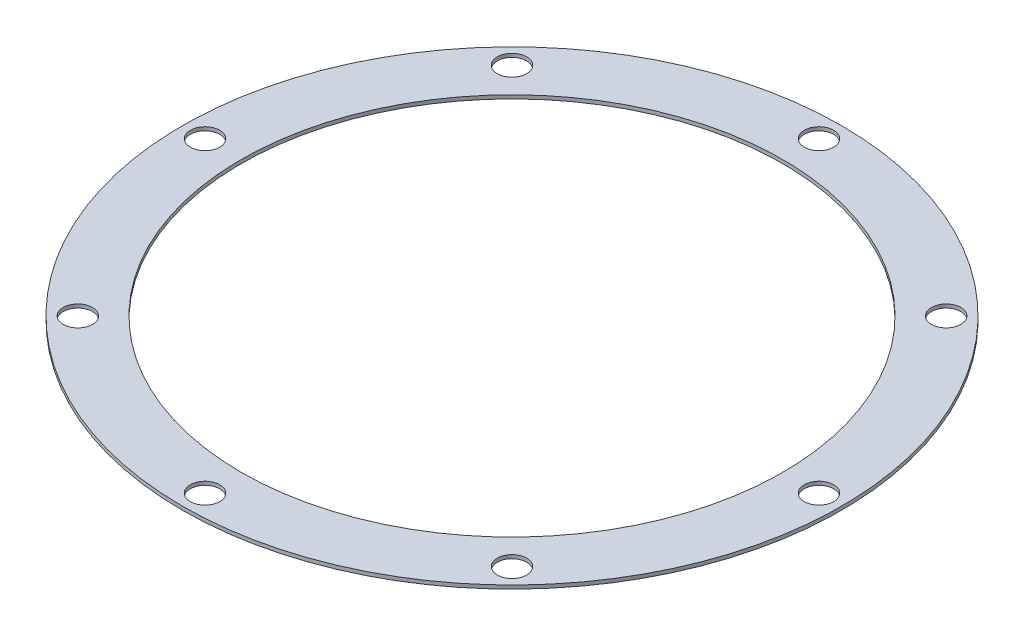
ISO-10303-21;
HEADER;
FILE_DESCRIPTION(('STEP AP214'),'2;1');
FILE_NAME('part.step','',(''),(''),'','','');
FILE_SCHEMA(('AUTOMOTIVE_DESIGN { 1 0 10303 214 1 1 1 1 }'));
ENDSEC;
DATA;
#1=APPLICATION_CONTEXT('core data for automotive mechanical design processes');
#2=APPLICATION_PROTOCOL_DEFINITION('international standard','automotive_design',2000,#1);
#3=PRODUCT_CONTEXT('',#1,'mechanical');
#4=PRODUCT('Part','Part','',(#3));
#5=PRODUCT_RELATED_PRODUCT_CATEGORY('part','',(#4));
#6=PRODUCT_DEFINITION_FORMATION('','',#4);
#7=PRODUCT_DEFINITION_CONTEXT('part definition',#1,'design');
#8=PRODUCT_DEFINITION('design','',#6,#7);
#9=PRODUCT_DEFINITION_SHAPE('','',#8);
#10=(LENGTH_UNIT() NAMED_UNIT(*) SI_UNIT(.MILLI.,.METRE.));
#11=(NAMED_UNIT(*) PLANE_ANGLE_UNIT() SI_UNIT($,.RADIAN.));
#12=(NAMED_UNIT(*) SI_UNIT($,.STERADIAN.) SOLID_ANGLE_UNIT());
#13=UNCERTAINTY_MEASURE_WITH_UNIT(LENGTH_MEASURE(1.E-05),#10,'distance_accuracy_value','');
#14=(GEOMETRIC_REPRESENTATION_CONTEXT(3) GLOBAL_UNCERTAINTY_ASSIGNED_CONTEXT((#13)) GLOBAL_UNIT_ASSIGNED_CONTEXT((#10,
#11,#12)) REPRESENTATION_CONTEXT('',''));
#15=CARTESIAN_POINT('',(0.,0.,0.));
#16=DIRECTION('',(0.,0.,1.));
#17=DIRECTION('',(1.,0.,0.));
#18=AXIS2_PLACEMENT_3D('',#15,#16,#17);
#19=CARTESIAN_POINT('',(0.,0.79375,0.));
#20=DIRECTION('',(0.,1.,0.));
#21=DIRECTION('',(0.,0.,1.));
#22=AXIS2_PLACEMENT_3D('',#19,#20,#21);
#23=PLANE('',#22);
#24=CARTESIAN_POINT('',(0.,0.79375,68.));
#25=DIRECTION('',(0.,1.,0.));
#26=DIRECTION('',(0.,0.,1.));
#27=AXIS2_PLACEMENT_3D('',#24,#25,#26);
#28=CIRCLE('',#27,3.25);
#29=CARTESIAN_POINT('',(0.,0.79375,71.25));
#30=VERTEX_POINT('',#29);
#31=EDGE_CURVE('E83',#30,#30,#28,.T.);
#32=ORIENTED_EDGE('',*,*,#31,.F.);
#33=EDGE_LOOP('',(#32));
#34=FACE_BOUND('',#33,.T.);
#35=CARTESIAN_POINT('',(68.,0.79375,0.));
#36=DIRECTION('',(0.,1.,0.));
#37=DIRECTION('',(0.,0.,1.));
#38=AXIS2_PLACEMENT_3D('',#35,#36,#37);
#39=CIRCLE('',#38,3.25000000000001);
#40=CARTESIAN_POINT('',(68.,0.79375,3.25));
#41=VERTEX_POINT('',#40);
#42=EDGE_CURVE('E71',#41,#41,#39,.T.);
#43=ORIENTED_EDGE('',*,*,#42,.F.);
#44=EDGE_LOOP('',(#43));
#45=FACE_BOUND('',#44,.T.);
#46=CARTESIAN_POINT('',(0.,0.79375,-68.));
#47=DIRECTION('',(0.,1.,0.));
#48=DIRECTION('',(0.,0.,1.));
#49=AXIS2_PLACEMENT_3D('',#46,#47,#48);
#50=CIRCLE('',#49,3.25);
#51=CARTESIAN_POINT('',(0.,0.79375,-64.75));
#52=VERTEX_POINT('',#51);
#53=EDGE_CURVE('E59',#52,#52,#50,.T.);
#54=ORIENTED_EDGE('',*,*,#53,.F.);
#55=EDGE_LOOP('',(#54));
#56=FACE_BOUND('',#55,.T.);
#57=CARTESIAN_POINT('',(-68.,0.79375,0.));
#58=DIRECTION('',(0.,1.,0.));
#59=DIRECTION('',(0.,0.,1.));
#60=AXIS2_PLACEMENT_3D('',#57,#58,#59);
#61=CIRCLE('',#60,3.25000000000001);
#62=CARTESIAN_POINT('',(-68.,0.79375,3.25000000000001));
#63=VERTEX_POINT('',#62);
#64=EDGE_CURVE('E47',#63,#63,#61,.T.);
#65=ORIENTED_EDGE('',*,*,#64,.F.);
#66=EDGE_LOOP('',(#65));
#67=FACE_BOUND('',#66,.T.);
#68=CARTESIAN_POINT('',(0.,0.79375,0.));
#69=DIRECTION('',(0.,1.,0.));
#70=DIRECTION('',(0.,0.,1.));
#71=AXIS2_PLACEMENT_3D('',#68,#69,#70);
#72=CIRCLE('',#71,73.);
#73=CARTESIAN_POINT('',(0.,0.79375,73.));
#74=VERTEX_POINT('',#73);
#75=EDGE_CURVE('E10',#74,#74,#72,.T.);
#76=ORIENTED_EDGE('',*,*,#75,.T.);
#77=EDGE_LOOP('',(#76));
#78=FACE_BOUND('',#77,.T.);
#79=CARTESIAN_POINT('',(0.,0.79375,0.));
#80=DIRECTION('',(0.,1.,0.));
#81=DIRECTION('',(0.,0.,1.));
#82=AXIS2_PLACEMENT_3D('',#79,#80,#81);
#83=CIRCLE('',#82,60.);
#84=CARTESIAN_POINT('',(0.,0.79375,60.));
#85=VERTEX_POINT('',#84);
#86=EDGE_CURVE('E42',#85,#85,#83,.T.);
#87=ORIENTED_EDGE('',*,*,#86,.F.);
#88=EDGE_LOOP('',(#87));
#89=FACE_BOUND('',#88,.T.);
#90=CARTESIAN_POINT('',(-48.0832611206852,0.79375,-48.0832611206852));
#91=DIRECTION('',(0.,1.,0.));
#92=DIRECTION('',(0.,0.,1.));
#93=AXIS2_PLACEMENT_3D('',#90,#91,#92);
#94=CIRCLE('',#93,3.25);
#95=CARTESIAN_POINT('',(-48.0832611206852,0.79375,-44.8332611206852));
#96=VERTEX_POINT('',#95);
#97=EDGE_CURVE('E53',#96,#96,#94,.T.);
#98=ORIENTED_EDGE('',*,*,#97,.F.);
#99=EDGE_LOOP('',(#98));
#100=FACE_BOUND('',#99,.T.);
#101=CARTESIAN_POINT('',(48.0832611206852,0.79375,-48.0832611206852));
#102=DIRECTION('',(0.,1.,0.));
#103=DIRECTION('',(0.,0.,1.));
#104=AXIS2_PLACEMENT_3D('',#101,#102,#103);
#105=CIRCLE('',#104,3.25);
#106=CARTESIAN_POINT('',(48.0832611206852,0.79375,-44.8332611206852));
#107=VERTEX_POINT('',#106);
#108=EDGE_CURVE('E65',#107,#107,#105,.T.);
#109=ORIENTED_EDGE('',*,*,#108,.F.);
#110=EDGE_LOOP('',(#109));
#111=FACE_BOUND('',#110,.T.);
#112=CARTESIAN_POINT('',(48.0832611206853,0.79375,48.0832611206852));
#113=DIRECTION('',(0.,1.,0.));
#114=DIRECTION('',(0.,0.,1.));
#115=AXIS2_PLACEMENT_3D('',#112,#113,#114);
#116=CIRCLE('',#115,3.25);
#117=CARTESIAN_POINT('',(48.0832611206853,0.79375,51.3332611206852));
#118=VERTEX_POINT('',#117);
#119=EDGE_CURVE('E77',#118,#118,#116,.T.);
#120=ORIENTED_EDGE('',*,*,#119,.F.);
#121=EDGE_LOOP('',(#120));
#122=FACE_BOUND('',#121,.T.);
#123=CARTESIAN_POINT('',(-48.0832611206852,0.79375,48.0832611206853));
#124=DIRECTION('',(0.,1.,0.));
#125=DIRECTION('',(0.,0.,1.));
#126=AXIS2_PLACEMENT_3D('',#123,#124,#125);
#127=CIRCLE('',#126,3.25);
#128=CARTESIAN_POINT('',(-48.0832611206852,0.79375,51.3332611206853));
#129=VERTEX_POINT('',#128);
#130=EDGE_CURVE('E89',#129,#129,#127,.T.);
#131=ORIENTED_EDGE('',*,*,#130,.F.);
#132=EDGE_LOOP('',(#131));
#133=FACE_BOUND('',#132,.T.);
#134=ADVANCED_FACE('F31',(#34,#45,#56,#67,#78,#89,#100,#111,#122,#133),#23,.T.);
#135=CARTESIAN_POINT('',(0.,0.,0.));
#136=DIRECTION('',(0.,1.,0.));
#137=DIRECTION('',(0.,0.,1.));
#138=AXIS2_PLACEMENT_3D('',#135,#136,#137);
#139=PLANE('',#138);
#140=CARTESIAN_POINT('',(0.,0.,68.));
#141=DIRECTION('',(0.,1.,0.));
#142=DIRECTION('',(0.,0.,1.));
#143=AXIS2_PLACEMENT_3D('',#140,#141,#142);
#144=CIRCLE('',#143,3.25);
#145=CARTESIAN_POINT('',(0.,0.,71.25));
#146=VERTEX_POINT('',#145);
#147=EDGE_CURVE('E86',#146,#146,#144,.T.);
#148=ORIENTED_EDGE('',*,*,#147,.T.);
#149=EDGE_LOOP('',(#148));
#150=FACE_BOUND('',#149,.T.);
#151=CARTESIAN_POINT('',(68.,0.,0.));
#152=DIRECTION('',(0.,1.,0.));
#153=DIRECTION('',(0.,0.,1.));
#154=AXIS2_PLACEMENT_3D('',#151,#152,#153);
#155=CIRCLE('',#154,3.25000000000001);
#156=CARTESIAN_POINT('',(68.,0.,3.25));
#157=VERTEX_POINT('',#156);
#158=EDGE_CURVE('E74',#157,#157,#155,.T.);
#159=ORIENTED_EDGE('',*,*,#158,.T.);
#160=EDGE_LOOP('',(#159));
#161=FACE_BOUND('',#160,.T.);
#162=CARTESIAN_POINT('',(0.,0.,-68.));
#163=DIRECTION('',(0.,1.,0.));
#164=DIRECTION('',(0.,0.,1.));
#165=AXIS2_PLACEMENT_3D('',#162,#163,#164);
#166=CIRCLE('',#165,3.25);
#167=CARTESIAN_POINT('',(0.,0.,-64.75));
#168=VERTEX_POINT('',#167);
#169=EDGE_CURVE('E62',#168,#168,#166,.T.);
#170=ORIENTED_EDGE('',*,*,#169,.T.);
#171=EDGE_LOOP('',(#170));
#172=FACE_BOUND('',#171,.T.);
#173=CARTESIAN_POINT('',(-68.,0.,0.));
#174=DIRECTION('',(0.,1.,0.));
#175=DIRECTION('',(0.,0.,1.));
#176=AXIS2_PLACEMENT_3D('',#173,#174,#175);
#177=CIRCLE('',#176,3.25000000000001);
#178=CARTESIAN_POINT('',(-68.,0.,3.25000000000001));
#179=VERTEX_POINT('',#178);
#180=EDGE_CURVE('E50',#179,#179,#177,.T.);
#181=ORIENTED_EDGE('',*,*,#180,.T.);
#182=EDGE_LOOP('',(#181));
#183=FACE_BOUND('',#182,.T.);
#184=CARTESIAN_POINT('',(0.,0.,0.));
#185=DIRECTION('',(0.,1.,0.));
#186=DIRECTION('',(0.,0.,1.));
#187=AXIS2_PLACEMENT_3D('',#184,#185,#186);
#188=CIRCLE('',#187,73.);
#189=CARTESIAN_POINT('',(0.,0.,73.));
#190=VERTEX_POINT('',#189);
#191=EDGE_CURVE('E35',#190,#190,#188,.T.);
#192=ORIENTED_EDGE('',*,*,#191,.F.);
#193=EDGE_LOOP('',(#192));
#194=FACE_BOUND('',#193,.T.);
#195=CARTESIAN_POINT('',(0.,0.,0.));
#196=DIRECTION('',(0.,1.,0.));
#197=DIRECTION('',(0.,0.,1.));
#198=AXIS2_PLACEMENT_3D('',#195,#196,#197);
#199=CIRCLE('',#198,60.);
#200=CARTESIAN_POINT('',(0.,0.,60.));
#201=VERTEX_POINT('',#200);
#202=EDGE_CURVE('E44',#201,#201,#199,.T.);
#203=ORIENTED_EDGE('',*,*,#202,.T.);
#204=EDGE_LOOP('',(#203));
#205=FACE_BOUND('',#204,.T.);
#206=CARTESIAN_POINT('',(-48.0832611206852,0.,-48.0832611206852));
#207=DIRECTION('',(0.,1.,0.));
#208=DIRECTION('',(0.,0.,1.));
#209=AXIS2_PLACEMENT_3D('',#206,#207,#208);
#210=CIRCLE('',#209,3.25);
#211=CARTESIAN_POINT('',(-48.0832611206852,0.,-44.8332611206852));
#212=VERTEX_POINT('',#211);
#213=EDGE_CURVE('E56',#212,#212,#210,.T.);
#214=ORIENTED_EDGE('',*,*,#213,.T.);
#215=EDGE_LOOP('',(#214));
#216=FACE_BOUND('',#215,.T.);
#217=CARTESIAN_POINT('',(48.0832611206852,0.,-48.0832611206852));
#218=DIRECTION('',(0.,1.,0.));
#219=DIRECTION('',(0.,0.,1.));
#220=AXIS2_PLACEMENT_3D('',#217,#218,#219);
#221=CIRCLE('',#220,3.25);
#222=CARTESIAN_POINT('',(48.0832611206852,0.,-44.8332611206852));
#223=VERTEX_POINT('',#222);
#224=EDGE_CURVE('E68',#223,#223,#221,.T.);
#225=ORIENTED_EDGE('',*,*,#224,.T.);
#226=EDGE_LOOP('',(#225));
#227=FACE_BOUND('',#226,.T.);
#228=CARTESIAN_POINT('',(48.0832611206853,0.,48.0832611206852));
#229=DIRECTION('',(0.,1.,0.));
#230=DIRECTION('',(0.,0.,1.));
#231=AXIS2_PLACEMENT_3D('',#228,#229,#230);
#232=CIRCLE('',#231,3.25);
#233=CARTESIAN_POINT('',(48.0832611206853,0.,51.3332611206852));
#234=VERTEX_POINT('',#233);
#235=EDGE_CURVE('E80',#234,#234,#232,.T.);
#236=ORIENTED_EDGE('',*,*,#235,.T.);
#237=EDGE_LOOP('',(#236));
#238=FACE_BOUND('',#237,.T.);
#239=CARTESIAN_POINT('',(-48.0832611206852,0.,48.0832611206853));
#240=DIRECTION('',(0.,1.,0.));
#241=DIRECTION('',(0.,0.,1.));
#242=AXIS2_PLACEMENT_3D('',#239,#240,#241);
#243=CIRCLE('',#242,3.25);
#244=CARTESIAN_POINT('',(-48.0832611206852,0.,51.3332611206853));
#245=VERTEX_POINT('',#244);
#246=EDGE_CURVE('E92',#245,#245,#243,.T.);
#247=ORIENTED_EDGE('',*,*,#246,.T.);
#248=EDGE_LOOP('',(#247));
#249=FACE_BOUND('',#248,.T.);
#250=ADVANCED_FACE('F102',(#150,#161,#172,#183,#194,#205,#216,#227,#238,#249),#139,.F.);
#251=CARTESIAN_POINT('',(0.,0.79375,0.));
#252=DIRECTION('',(0.,-1.,0.));
#253=DIRECTION('',(0.,0.,-1.));
#254=AXIS2_PLACEMENT_3D('',#251,#252,#253);
#255=CYLINDRICAL_SURFACE('',#254,73.);
#256=ORIENTED_EDGE('',*,*,#75,.F.);
#257=EDGE_LOOP('',(#256));
#258=FACE_BOUND('',#257,.T.);
#259=ORIENTED_EDGE('',*,*,#191,.T.);
#260=EDGE_LOOP('',(#259));
#261=FACE_BOUND('',#260,.T.);
#262=ADVANCED_FACE('F33',(#258,#261),#255,.T.);
#263=CARTESIAN_POINT('',(0.,0.79375,0.));
#264=DIRECTION('',(0.,-1.,0.));
#265=DIRECTION('',(0.,0.,-1.));
#266=AXIS2_PLACEMENT_3D('',#263,#264,#265);
#267=CYLINDRICAL_SURFACE('',#266,60.);
#268=ORIENTED_EDGE('',*,*,#86,.T.);
#269=EDGE_LOOP('',(#268));
#270=FACE_BOUND('',#269,.T.);
#271=ORIENTED_EDGE('',*,*,#202,.F.);
#272=EDGE_LOOP('',(#271));
#273=FACE_BOUND('',#272,.T.);
#274=ADVANCED_FACE('F112',(#270,#273),#267,.F.);
#275=CARTESIAN_POINT('',(-68.,0.79375,0.));
#276=DIRECTION('',(0.,-1.,0.));
#277=DIRECTION('',(0.,0.,-1.));
#278=AXIS2_PLACEMENT_3D('',#275,#276,#277);
#279=CYLINDRICAL_SURFACE('',#278,3.25000000000001);
#280=ORIENTED_EDGE('',*,*,#64,.T.);
#281=EDGE_LOOP('',(#280));
#282=FACE_BOUND('',#281,.T.);
#283=ORIENTED_EDGE('',*,*,#180,.F.);
#284=EDGE_LOOP('',(#283));
#285=FACE_BOUND('',#284,.T.);
#286=ADVANCED_FACE('F115',(#282,#285),#279,.F.);
#287=CARTESIAN_POINT('',(-48.0832611206852,0.79375,-48.0832611206852));
#288=DIRECTION('',(0.,-1.,0.));
#289=DIRECTION('',(0.,0.,-1.));
#290=AXIS2_PLACEMENT_3D('',#287,#288,#289);
#291=CYLINDRICAL_SURFACE('',#290,3.25);
#292=ORIENTED_EDGE('',*,*,#97,.T.);
#293=EDGE_LOOP('',(#292));
#294=FACE_BOUND('',#293,.T.);
#295=ORIENTED_EDGE('',*,*,#213,.F.);
#296=EDGE_LOOP('',(#295));
#297=FACE_BOUND('',#296,.T.);
#298=ADVANCED_FACE('F119',(#294,#297),#291,.F.);
#299=CARTESIAN_POINT('',(0.,0.79375,-68.));
#300=DIRECTION('',(0.,-1.,0.));
#301=DIRECTION('',(0.,0.,-1.));
#302=AXIS2_PLACEMENT_3D('',#299,#300,#301);
#303=CYLINDRICAL_SURFACE('',#302,3.25);
#304=ORIENTED_EDGE('',*,*,#53,.T.);
#305=EDGE_LOOP('',(#304));
#306=FACE_BOUND('',#305,.T.);
#307=ORIENTED_EDGE('',*,*,#169,.F.);
#308=EDGE_LOOP('',(#307));
#309=FACE_BOUND('',#308,.T.);
#310=ADVANCED_FACE('F123',(#306,#309),#303,.F.);
#311=CARTESIAN_POINT('',(48.0832611206852,0.79375,-48.0832611206852));
#312=DIRECTION('',(0.,-1.,0.));
#313=DIRECTION('',(0.,0.,-1.));
#314=AXIS2_PLACEMENT_3D('',#311,#312,#313);
#315=CYLINDRICAL_SURFACE('',#314,3.25);
#316=ORIENTED_EDGE('',*,*,#108,.T.);
#317=EDGE_LOOP('',(#316));
#318=FACE_BOUND('',#317,.T.);
#319=ORIENTED_EDGE('',*,*,#224,.F.);
#320=EDGE_LOOP('',(#319));
#321=FACE_BOUND('',#320,.T.);
#322=ADVANCED_FACE('F127',(#318,#321),#315,.F.);
#323=CARTESIAN_POINT('',(68.,0.79375,0.));
#324=DIRECTION('',(0.,-1.,0.));
#325=DIRECTION('',(0.,0.,-1.));
#326=AXIS2_PLACEMENT_3D('',#323,#324,#325);
#327=CYLINDRICAL_SURFACE('',#326,3.25000000000001);
#328=ORIENTED_EDGE('',*,*,#42,.T.);
#329=EDGE_LOOP('',(#328));
#330=FACE_BOUND('',#329,.T.);
#331=ORIENTED_EDGE('',*,*,#158,.F.);
#332=EDGE_LOOP('',(#331));
#333=FACE_BOUND('',#332,.T.);
#334=ADVANCED_FACE('F131',(#330,#333),#327,.F.);
#335=CARTESIAN_POINT('',(48.0832611206853,0.79375,48.0832611206852));
#336=DIRECTION('',(0.,-1.,0.));
#337=DIRECTION('',(0.,0.,-1.));
#338=AXIS2_PLACEMENT_3D('',#335,#336,#337);
#339=CYLINDRICAL_SURFACE('',#338,3.25);
#340=ORIENTED_EDGE('',*,*,#119,.T.);
#341=EDGE_LOOP('',(#340));
#342=FACE_BOUND('',#341,.T.);
#343=ORIENTED_EDGE('',*,*,#235,.F.);
#344=EDGE_LOOP('',(#343));
#345=FACE_BOUND('',#344,.T.);
#346=ADVANCED_FACE('F135',(#342,#345),#339,.F.);
#347=CARTESIAN_POINT('',(0.,0.79375,68.));
#348=DIRECTION('',(0.,-1.,0.));
#349=DIRECTION('',(0.,0.,-1.));
#350=AXIS2_PLACEMENT_3D('',#347,#348,#349);
#351=CYLINDRICAL_SURFACE('',#350,3.25);
#352=ORIENTED_EDGE('',*,*,#31,.T.);
#353=EDGE_LOOP('',(#352));
#354=FACE_BOUND('',#353,.T.);
#355=ORIENTED_EDGE('',*,*,#147,.F.);
#356=EDGE_LOOP('',(#355));
#357=FACE_BOUND('',#356,.T.);
#358=ADVANCED_FACE('F139',(#354,#357),#351,.F.);
#359=CARTESIAN_POINT('',(-48.0832611206852,0.79375,48.0832611206853));
#360=DIRECTION('',(0.,-1.,0.));
#361=DIRECTION('',(0.,0.,-1.));
#362=AXIS2_PLACEMENT_3D('',#359,#360,#361);
#363=CYLINDRICAL_SURFACE('',#362,3.25);
#364=ORIENTED_EDGE('',*,*,#130,.T.);
#365=EDGE_LOOP('',(#364));
#366=FACE_BOUND('',#365,.T.);
#367=ORIENTED_EDGE('',*,*,#246,.F.);
#368=EDGE_LOOP('',(#367));
#369=FACE_BOUND('',#368,.T.);
#370=ADVANCED_FACE('F98',(#366,#369),#363,.F.);
#371=CLOSED_SHELL('',(#134,#250,#262,#274,#286,#298,#310,#322,#334,#346,#358,#370));
#372=MANIFOLD_SOLID_BREP('B2',#371);
#373=ADVANCED_BREP_SHAPE_REPRESENTATION('',(#18,#372),#14);
#374=SHAPE_DEFINITION_REPRESENTATION(#9,#373);
ENDSEC;
END-ISO-10303-21;
